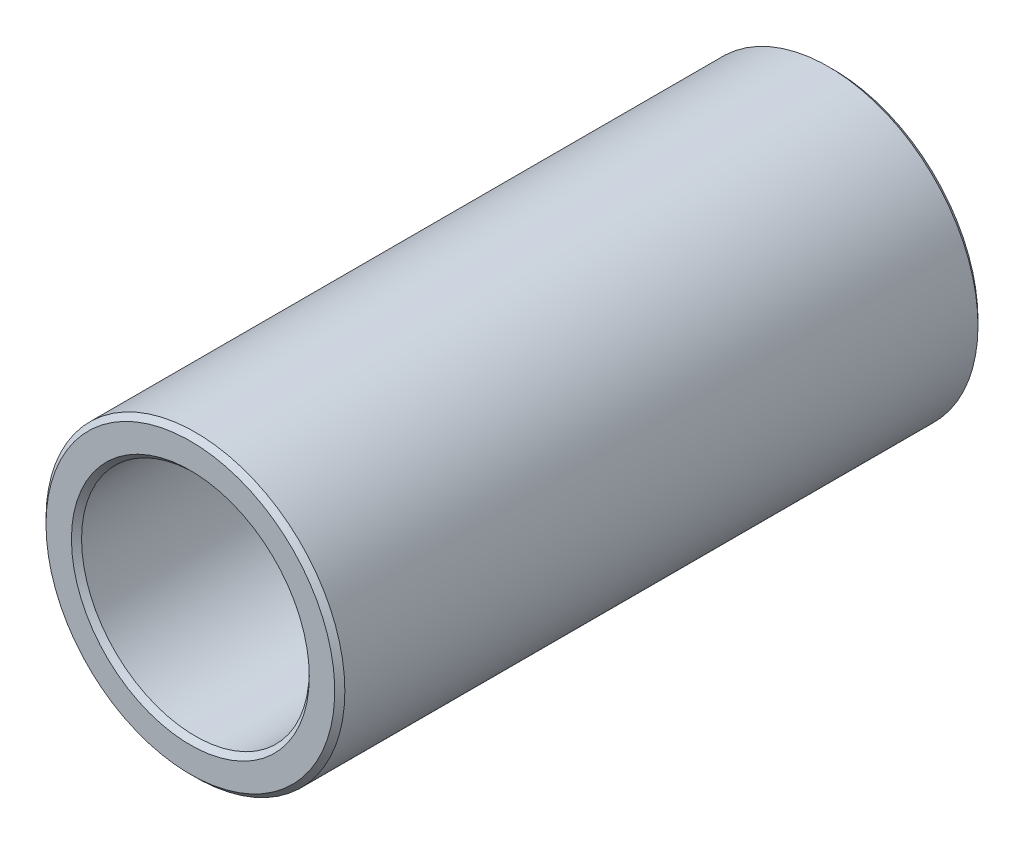
ISO-10303-21;
HEADER;
FILE_DESCRIPTION(('STEP AP214'),'2;1');
FILE_NAME('part.step','',(''),(''),'','','');
FILE_SCHEMA(('AUTOMOTIVE_DESIGN { 1 0 10303 214 1 1 1 1 }'));
ENDSEC;
DATA;
#1=APPLICATION_CONTEXT('core data for automotive mechanical design processes');
#2=APPLICATION_PROTOCOL_DEFINITION('international standard','automotive_design',2000,#1);
#3=PRODUCT_CONTEXT('',#1,'mechanical');
#4=PRODUCT('Part','Part','',(#3));
#5=PRODUCT_RELATED_PRODUCT_CATEGORY('part','',(#4));
#6=PRODUCT_DEFINITION_FORMATION('','',#4);
#7=PRODUCT_DEFINITION_CONTEXT('part definition',#1,'design');
#8=PRODUCT_DEFINITION('design','',#6,#7);
#9=PRODUCT_DEFINITION_SHAPE('','',#8);
#10=(LENGTH_UNIT() NAMED_UNIT(*) SI_UNIT(.MILLI.,.METRE.));
#11=(NAMED_UNIT(*) PLANE_ANGLE_UNIT() SI_UNIT($,.RADIAN.));
#12=(NAMED_UNIT(*) SI_UNIT($,.STERADIAN.) SOLID_ANGLE_UNIT());
#13=UNCERTAINTY_MEASURE_WITH_UNIT(LENGTH_MEASURE(1.E-05),#10,'distance_accuracy_value','');
#14=(GEOMETRIC_REPRESENTATION_CONTEXT(3) GLOBAL_UNCERTAINTY_ASSIGNED_CONTEXT((#13)) GLOBAL_UNIT_ASSIGNED_CONTEXT((#10,
#11,#12)) REPRESENTATION_CONTEXT('',''));
#15=CARTESIAN_POINT('',(0.,0.,0.));
#16=DIRECTION('',(0.,0.,1.));
#17=DIRECTION('',(1.,0.,0.));
#18=AXIS2_PLACEMENT_3D('',#15,#16,#17);
#19=CARTESIAN_POINT('',(0.,0.,7.37616));
#20=DIRECTION('',(0.,0.,1.));
#21=DIRECTION('',(1.,0.,0.));
#22=AXIS2_PLACEMENT_3D('',#19,#20,#21);
#23=CYLINDRICAL_SURFACE('',#22,2.2479);
#24=CARTESIAN_POINT('',(0.,0.,6.24999999996589));
#25=DIRECTION('',(0.,0.,1.));
#26=DIRECTION('',(-1.,0.,0.));
#27=AXIS2_PLACEMENT_3D('',#24,#25,#26);
#28=CIRCLE('',#27,2.2478999999862);
#29=CARTESIAN_POINT('',(-2.2478999999862,0.,6.24999999996589));
#30=VERTEX_POINT('',#29);
#31=EDGE_CURVE('E30',#30,#30,#28,.T.);
#32=ORIENTED_EDGE('',*,*,#31,.T.);
#33=EDGE_LOOP('',(#32));
#34=FACE_BOUND('',#33,.T.);
#35=CARTESIAN_POINT('',(0.,0.,-6.24999999996589));
#36=DIRECTION('',(0.,0.,-1.));
#37=DIRECTION('',(1.,0.,0.));
#38=AXIS2_PLACEMENT_3D('',#35,#36,#37);
#39=CIRCLE('',#38,2.2478999999862);
#40=CARTESIAN_POINT('',(2.2478999999862,0.,-6.24999999996589));
#41=VERTEX_POINT('',#40);
#42=EDGE_CURVE('E33',#41,#41,#39,.T.);
#43=ORIENTED_EDGE('',*,*,#42,.T.);
#44=EDGE_LOOP('',(#43));
#45=FACE_BOUND('',#44,.T.);
#46=ADVANCED_FACE('F15',(#34,#45),#23,.F.);
#47=CARTESIAN_POINT('',(0.,0.,-6.34999999999764));
#48=DIRECTION('',(0.,0.,-1.));
#49=DIRECTION('',(-1.,0.,0.));
#50=AXIS2_PLACEMENT_3D('',#47,#48,#49);
#51=CONICAL_SURFACE('',#50,2.34790000001794,0.785398163397448);
#52=CARTESIAN_POINT('',(0.,0.,-6.34999999999764));
#53=DIRECTION('',(0.,0.,-1.));
#54=DIRECTION('',(-1.,0.,0.));
#55=AXIS2_PLACEMENT_3D('',#52,#53,#54);
#56=CIRCLE('',#55,2.34790000001794);
#57=CARTESIAN_POINT('',(-2.34790000001794,0.,-6.34999999999764));
#58=VERTEX_POINT('',#57);
#59=EDGE_CURVE('E18',#58,#58,#56,.T.);
#60=ORIENTED_EDGE('',*,*,#59,.T.);
#61=EDGE_LOOP('',(#60));
#62=FACE_BOUND('',#61,.T.);
#63=ORIENTED_EDGE('',*,*,#42,.F.);
#64=EDGE_LOOP('',(#63));
#65=FACE_BOUND('',#64,.T.);
#66=ADVANCED_FACE('F47',(#62,#65),#51,.F.);
#67=CARTESIAN_POINT('',(0.,0.,6.34999999999764));
#68=DIRECTION('',(0.,0.,1.));
#69=DIRECTION('',(1.,0.,0.));
#70=AXIS2_PLACEMENT_3D('',#67,#68,#69);
#71=CONICAL_SURFACE('',#70,2.34790000001794,0.785398163397448);
#72=CARTESIAN_POINT('',(0.,0.,6.34999999999764));
#73=DIRECTION('',(0.,0.,1.));
#74=DIRECTION('',(1.,0.,0.));
#75=AXIS2_PLACEMENT_3D('',#72,#73,#74);
#76=CIRCLE('',#75,2.34790000001794);
#77=CARTESIAN_POINT('',(2.34790000001794,0.,6.34999999999764));
#78=VERTEX_POINT('',#77);
#79=EDGE_CURVE('E40',#78,#78,#76,.T.);
#80=ORIENTED_EDGE('',*,*,#79,.T.);
#81=EDGE_LOOP('',(#80));
#82=FACE_BOUND('',#81,.T.);
#83=ORIENTED_EDGE('',*,*,#31,.F.);
#84=EDGE_LOOP('',(#83));
#85=FACE_BOUND('',#84,.T.);
#86=ADVANCED_FACE('F54',(#82,#85),#71,.F.);
#87=CARTESIAN_POINT('',(0.,2.95,-6.35));
#88=DIRECTION('',(0.,0.,1.));
#89=DIRECTION('',(1.,0.,0.));
#90=AXIS2_PLACEMENT_3D('',#87,#88,#89);
#91=PLANE('',#90);
#92=ORIENTED_EDGE('',*,*,#59,.F.);
#93=EDGE_LOOP('',(#92));
#94=FACE_BOUND('',#93,.T.);
#95=CARTESIAN_POINT('',(0.,0.,-6.35000000005448));
#96=DIRECTION('',(0.,0.,1.));
#97=DIRECTION('',(1.,0.,0.));
#98=AXIS2_PLACEMENT_3D('',#95,#96,#97);
#99=CIRCLE('',#98,2.85000000002356);
#100=CARTESIAN_POINT('',(2.85000000002356,0.,-6.35000000005448));
#101=VERTEX_POINT('',#100);
#102=EDGE_CURVE('E38',#101,#101,#99,.T.);
#103=ORIENTED_EDGE('',*,*,#102,.F.);
#104=EDGE_LOOP('',(#103));
#105=FACE_BOUND('',#104,.T.);
#106=ADVANCED_FACE('F50',(#94,#105),#91,.F.);
#107=CARTESIAN_POINT('',(0.,2.95,6.35));
#108=DIRECTION('',(0.,0.,-1.));
#109=DIRECTION('',(-1.,0.,0.));
#110=AXIS2_PLACEMENT_3D('',#107,#108,#109);
#111=PLANE('',#110);
#112=ORIENTED_EDGE('',*,*,#79,.F.);
#113=EDGE_LOOP('',(#112));
#114=FACE_BOUND('',#113,.T.);
#115=CARTESIAN_POINT('',(0.,0.,6.34999999999764));
#116=DIRECTION('',(0.,0.,-1.));
#117=DIRECTION('',(-1.,0.,0.));
#118=AXIS2_PLACEMENT_3D('',#115,#116,#117);
#119=CIRCLE('',#118,2.8500000000804);
#120=CARTESIAN_POINT('',(-2.8500000000804,0.,6.34999999999764));
#121=VERTEX_POINT('',#120);
#122=EDGE_CURVE('E27',#121,#121,#119,.T.);
#123=ORIENTED_EDGE('',*,*,#122,.F.);
#124=EDGE_LOOP('',(#123));
#125=FACE_BOUND('',#124,.T.);
#126=ADVANCED_FACE('F53',(#114,#125),#111,.F.);
#127=CARTESIAN_POINT('',(0.,0.,-6.25000000002274));
#128=DIRECTION('',(0.,0.,1.));
#129=DIRECTION('',(1.,0.,0.));
#130=AXIS2_PLACEMENT_3D('',#127,#128,#129);
#131=CONICAL_SURFACE('',#130,2.94999999999845,0.785398163113231);
#132=CARTESIAN_POINT('',(0.,0.,-6.25));
#133=DIRECTION('',(0.,0.,1.));
#134=DIRECTION('',(1.,0.,0.));
#135=AXIS2_PLACEMENT_3D('',#132,#133,#134);
#136=CIRCLE('',#135,2.95);
#137=CARTESIAN_POINT('',(2.95,0.,-6.25));
#138=VERTEX_POINT('',#137);
#139=EDGE_CURVE('E22',#138,#138,#136,.T.);
#140=ORIENTED_EDGE('',*,*,#139,.F.);
#141=EDGE_LOOP('',(#140));
#142=FACE_BOUND('',#141,.T.);
#143=ORIENTED_EDGE('',*,*,#102,.T.);
#144=EDGE_LOOP('',(#143));
#145=FACE_BOUND('',#144,.T.);
#146=ADVANCED_FACE('F58',(#142,#145),#131,.T.);
#147=CARTESIAN_POINT('',(0.,0.,6.25000000007958));
#148=DIRECTION('',(0.,0.,-1.));
#149=DIRECTION('',(-1.,0.,0.));
#150=AXIS2_PLACEMENT_3D('',#147,#148,#149);
#151=CONICAL_SURFACE('',#150,2.94999999999845,0.785398163397448);
#152=CARTESIAN_POINT('',(0.,0.,6.25));
#153=DIRECTION('',(0.,0.,1.));
#154=DIRECTION('',(1.,0.,0.));
#155=AXIS2_PLACEMENT_3D('',#152,#153,#154);
#156=CIRCLE('',#155,2.95);
#157=CARTESIAN_POINT('',(2.95,0.,6.25));
#158=VERTEX_POINT('',#157);
#159=EDGE_CURVE('E10',#158,#158,#156,.F.);
#160=ORIENTED_EDGE('',*,*,#159,.F.);
#161=EDGE_LOOP('',(#160));
#162=FACE_BOUND('',#161,.T.);
#163=ORIENTED_EDGE('',*,*,#122,.T.);
#164=EDGE_LOOP('',(#163));
#165=FACE_BOUND('',#164,.T.);
#166=ADVANCED_FACE('F60',(#162,#165),#151,.T.);
#167=CARTESIAN_POINT('',(0.,0.,7.37616));
#168=DIRECTION('',(0.,0.,1.));
#169=DIRECTION('',(1.,0.,0.));
#170=AXIS2_PLACEMENT_3D('',#167,#168,#169);
#171=CYLINDRICAL_SURFACE('',#170,2.95);
#172=ORIENTED_EDGE('',*,*,#159,.T.);
#173=EDGE_LOOP('',(#172));
#174=FACE_BOUND('',#173,.T.);
#175=ORIENTED_EDGE('',*,*,#139,.T.);
#176=EDGE_LOOP('',(#175));
#177=FACE_BOUND('',#176,.T.);
#178=ADVANCED_FACE('F68',(#174,#177),#171,.T.);
#179=CLOSED_SHELL('',(#46,#66,#86,#106,#126,#146,#166,#178));
#180=MANIFOLD_SOLID_BREP('B1',#179);
#181=ADVANCED_BREP_SHAPE_REPRESENTATION('',(#18,#180),#14);
#182=SHAPE_DEFINITION_REPRESENTATION(#9,#181);
ENDSEC;
END-ISO-10303-21;
